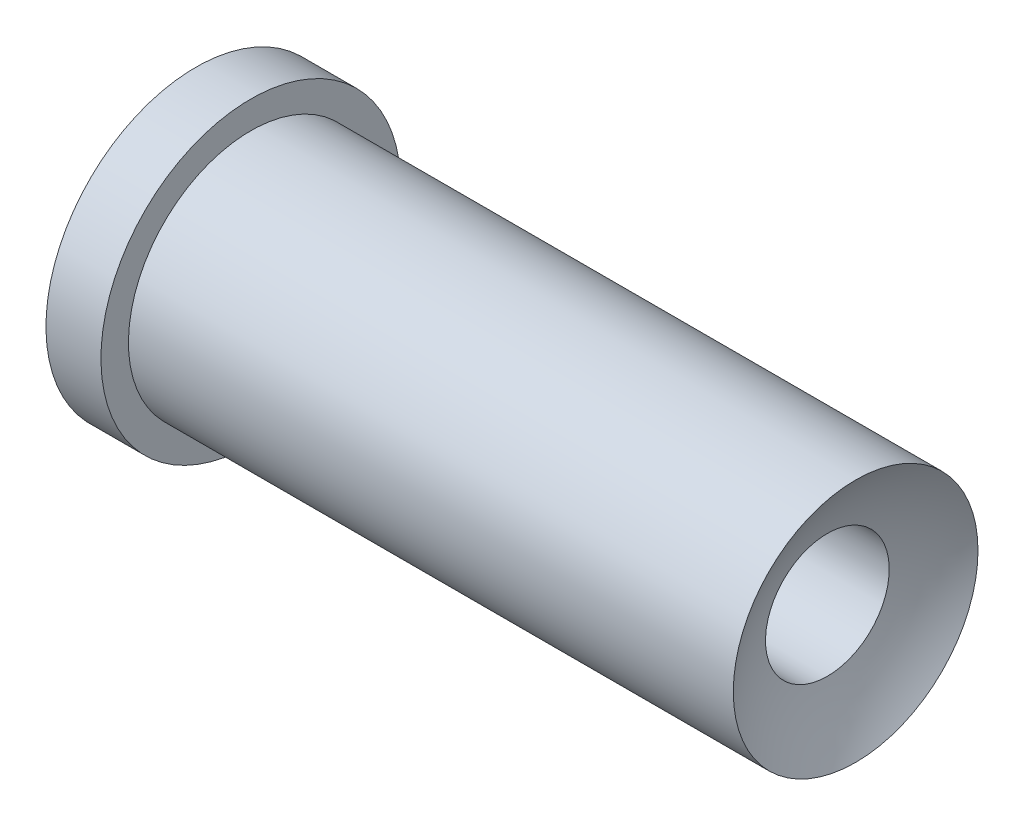
ISO-10303-21;
HEADER;
FILE_DESCRIPTION(('STEP AP214'),'2;1');
FILE_NAME('part.step','',(''),(''),'','','');
FILE_SCHEMA(('AUTOMOTIVE_DESIGN { 1 0 10303 214 1 1 1 1 }'));
ENDSEC;
DATA;
#1=APPLICATION_CONTEXT('core data for automotive mechanical design processes');
#2=APPLICATION_PROTOCOL_DEFINITION('international standard','automotive_design',2000,#1);
#3=PRODUCT_CONTEXT('',#1,'mechanical');
#4=PRODUCT('Part','Part','',(#3));
#5=PRODUCT_RELATED_PRODUCT_CATEGORY('part','',(#4));
#6=PRODUCT_DEFINITION_FORMATION('','',#4);
#7=PRODUCT_DEFINITION_CONTEXT('part definition',#1,'design');
#8=PRODUCT_DEFINITION('design','',#6,#7);
#9=PRODUCT_DEFINITION_SHAPE('','',#8);
#10=(LENGTH_UNIT() NAMED_UNIT(*) SI_UNIT(.MILLI.,.METRE.));
#11=(NAMED_UNIT(*) PLANE_ANGLE_UNIT() SI_UNIT($,.RADIAN.));
#12=(NAMED_UNIT(*) SI_UNIT($,.STERADIAN.) SOLID_ANGLE_UNIT());
#13=UNCERTAINTY_MEASURE_WITH_UNIT(LENGTH_MEASURE(1.E-05),#10,'distance_accuracy_value','');
#14=(GEOMETRIC_REPRESENTATION_CONTEXT(3) GLOBAL_UNCERTAINTY_ASSIGNED_CONTEXT((#13)) GLOBAL_UNIT_ASSIGNED_CONTEXT((#10,
#11,#12)) REPRESENTATION_CONTEXT('',''));
#15=CARTESIAN_POINT('',(0.,0.,0.));
#16=DIRECTION('',(0.,0.,1.));
#17=DIRECTION('',(1.,0.,0.));
#18=AXIS2_PLACEMENT_3D('',#15,#16,#17);
#19=CARTESIAN_POINT('',(-120.,54.5,0.));
#20=DIRECTION('',(1.,0.,0.));
#21=DIRECTION('',(0.,1.,0.));
#22=AXIS2_PLACEMENT_3D('',#19,#20,#21);
#23=PLANE('',#22);
#24=CARTESIAN_POINT('',(-120.,0.,0.));
#25=DIRECTION('',(-1.,0.,0.));
#26=DIRECTION('',(0.,-1.,0.));
#27=AXIS2_PLACEMENT_3D('',#24,#25,#26);
#28=CIRCLE('',#27,54.5);
#29=CARTESIAN_POINT('',(-120.,-54.5,0.));
#30=VERTEX_POINT('',#29);
#31=EDGE_CURVE('E40',#30,#30,#28,.T.);
#32=ORIENTED_EDGE('',*,*,#31,.T.);
#33=EDGE_LOOP('',(#32));
#34=FACE_BOUND('',#33,.T.);
#35=ADVANCED_FACE('F30',(#34),#23,.F.);
#36=CARTESIAN_POINT('',(-120.,0.,0.));
#37=DIRECTION('',(-1.,0.,0.));
#38=DIRECTION('',(0.,-1.,0.));
#39=AXIS2_PLACEMENT_3D('',#36,#37,#38);
#40=CYLINDRICAL_SURFACE('',#39,44.5);
#41=CARTESIAN_POINT('',(-100.,0.,0.));
#42=DIRECTION('',(-1.,0.,0.));
#43=DIRECTION('',(0.,-1.,0.));
#44=AXIS2_PLACEMENT_3D('',#41,#42,#43);
#45=CIRCLE('',#44,44.5);
#46=CARTESIAN_POINT('',(-100.,-44.5,0.));
#47=VERTEX_POINT('',#46);
#48=EDGE_CURVE('E10',#47,#47,#45,.T.);
#49=ORIENTED_EDGE('',*,*,#48,.F.);
#50=EDGE_LOOP('',(#49));
#51=FACE_BOUND('',#50,.T.);
#52=CARTESIAN_POINT('',(120.,0.,0.));
#53=DIRECTION('',(1.,0.,0.));
#54=DIRECTION('',(0.,1.,0.));
#55=AXIS2_PLACEMENT_3D('',#52,#53,#54);
#56=CIRCLE('',#55,44.5);
#57=CARTESIAN_POINT('',(120.,44.5,0.));
#58=VERTEX_POINT('',#57);
#59=EDGE_CURVE('E44',#58,#58,#56,.T.);
#60=ORIENTED_EDGE('',*,*,#59,.F.);
#61=EDGE_LOOP('',(#60));
#62=FACE_BOUND('',#61,.T.);
#63=ADVANCED_FACE('F70',(#51,#62),#40,.T.);
#64=CARTESIAN_POINT('',(-100.,44.5,0.));
#65=DIRECTION('',(-1.,0.,0.));
#66=DIRECTION('',(0.,-1.,0.));
#67=AXIS2_PLACEMENT_3D('',#64,#65,#66);
#68=PLANE('',#67);
#69=CARTESIAN_POINT('',(-100.,0.,0.));
#70=DIRECTION('',(-1.,0.,0.));
#71=DIRECTION('',(0.,-1.,0.));
#72=AXIS2_PLACEMENT_3D('',#69,#70,#71);
#73=CIRCLE('',#72,54.5);
#74=CARTESIAN_POINT('',(-100.,-54.5,0.));
#75=VERTEX_POINT('',#74);
#76=EDGE_CURVE('E36',#75,#75,#73,.T.);
#77=ORIENTED_EDGE('',*,*,#76,.F.);
#78=EDGE_LOOP('',(#77));
#79=FACE_BOUND('',#78,.T.);
#80=ORIENTED_EDGE('',*,*,#48,.T.);
#81=EDGE_LOOP('',(#80));
#82=FACE_BOUND('',#81,.T.);
#83=ADVANCED_FACE('F75',(#79,#82),#68,.F.);
#84=CARTESIAN_POINT('',(-120.,0.,0.));
#85=DIRECTION('',(-1.,0.,0.));
#86=DIRECTION('',(0.,-1.,0.));
#87=AXIS2_PLACEMENT_3D('',#84,#85,#86);
#88=CYLINDRICAL_SURFACE('',#87,54.5);
#89=ORIENTED_EDGE('',*,*,#31,.F.);
#90=EDGE_LOOP('',(#89));
#91=FACE_BOUND('',#90,.T.);
#92=ORIENTED_EDGE('',*,*,#76,.T.);
#93=EDGE_LOOP('',(#92));
#94=FACE_BOUND('',#93,.T.);
#95=ADVANCED_FACE('F79',(#91,#94),#88,.T.);
#96=CARTESIAN_POINT('',(186.481200350174,0.,0.));
#97=DIRECTION('',(-1.,0.,0.));
#98=DIRECTION('',(0.,-1.,0.));
#99=AXIS2_PLACEMENT_3D('',#96,#97,#98);
#100=SPHERICAL_SURFACE('',#99,80.);
#101=CARTESIAN_POINT('',(109.710437686254,0.,0.));
#102=DIRECTION('',(-1.,0.,0.));
#103=DIRECTION('',(0.,-1.,0.));
#104=AXIS2_PLACEMENT_3D('',#101,#102,#103);
#105=CIRCLE('',#104,22.5);
#106=CARTESIAN_POINT('',(109.710437686254,-22.5,0.));
#107=VERTEX_POINT('',#106);
#108=EDGE_CURVE('E52',#107,#107,#105,.T.);
#109=ORIENTED_EDGE('',*,*,#108,.T.);
#110=EDGE_LOOP('',(#109));
#111=FACE_BOUND('',#110,.T.);
#112=ORIENTED_EDGE('',*,*,#59,.T.);
#113=EDGE_LOOP('',(#112));
#114=FACE_BOUND('',#113,.T.);
#115=ADVANCED_FACE('F56',(#111,#114),#100,.F.);
#116=CARTESIAN_POINT('',(66.4812003501742,0.,0.));
#117=DIRECTION('',(1.,0.,0.));
#118=DIRECTION('',(0.,1.,0.));
#119=AXIS2_PLACEMENT_3D('',#116,#117,#118);
#120=PLANE('',#119);
#121=CARTESIAN_POINT('',(66.4812003501742,0.,0.));
#122=DIRECTION('',(-1.,0.,0.));
#123=DIRECTION('',(0.,-1.,0.));
#124=AXIS2_PLACEMENT_3D('',#121,#122,#123);
#125=CIRCLE('',#124,22.5);
#126=CARTESIAN_POINT('',(66.4812003501742,-22.5,0.));
#127=VERTEX_POINT('',#126);
#128=EDGE_CURVE('E49',#127,#127,#125,.T.);
#129=ORIENTED_EDGE('',*,*,#128,.F.);
#130=EDGE_LOOP('',(#129));
#131=FACE_BOUND('',#130,.T.);
#132=ADVANCED_FACE('F61',(#131),#120,.T.);
#133=CARTESIAN_POINT('',(66.4812003501742,0.,0.));
#134=DIRECTION('',(-1.,0.,0.));
#135=DIRECTION('',(0.,-1.,0.));
#136=AXIS2_PLACEMENT_3D('',#133,#134,#135);
#137=CYLINDRICAL_SURFACE('',#136,22.5);
#138=ORIENTED_EDGE('',*,*,#128,.T.);
#139=EDGE_LOOP('',(#138));
#140=FACE_BOUND('',#139,.T.);
#141=ORIENTED_EDGE('',*,*,#108,.F.);
#142=EDGE_LOOP('',(#141));
#143=FACE_BOUND('',#142,.T.);
#144=ADVANCED_FACE('F59',(#140,#143),#137,.F.);
#145=CLOSED_SHELL('',(#35,#63,#83,#95,#115,#132,#144));
#146=MANIFOLD_SOLID_BREP('B2',#145);
#147=ADVANCED_BREP_SHAPE_REPRESENTATION('',(#18,#146),#14);
#148=SHAPE_DEFINITION_REPRESENTATION(#9,#147);
ENDSEC;
END-ISO-10303-21;
